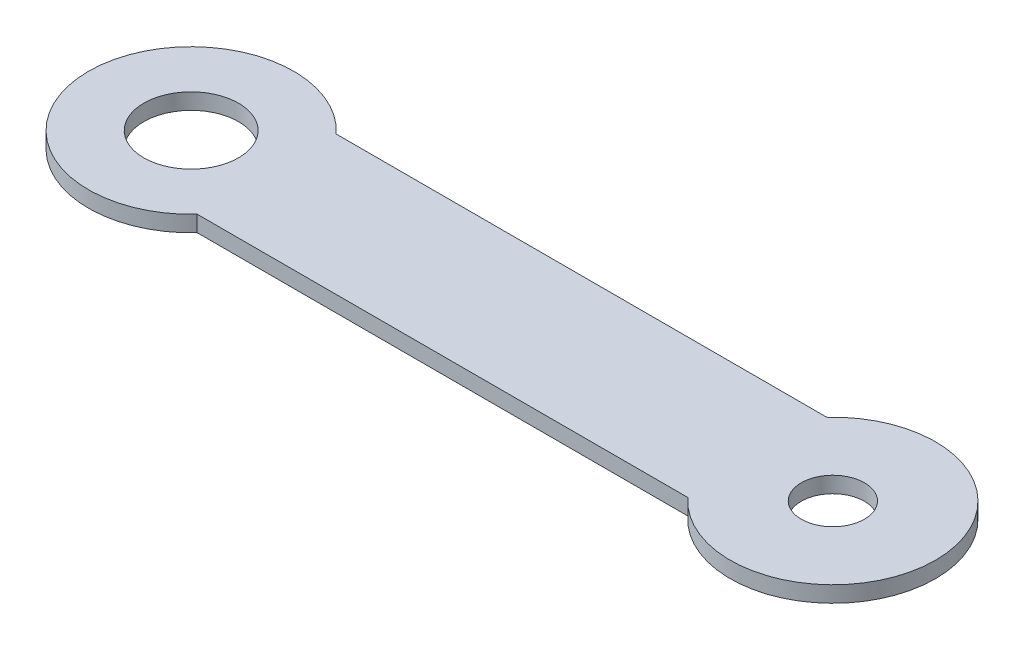
ISO-10303-21;
HEADER;
FILE_DESCRIPTION(('STEP AP214'),'2;1');
FILE_NAME('part.step','',(''),(''),'','','');
FILE_SCHEMA(('AUTOMOTIVE_DESIGN { 1 0 10303 214 1 1 1 1 }'));
ENDSEC;
DATA;
#1=APPLICATION_CONTEXT('core data for automotive mechanical design processes');
#2=APPLICATION_PROTOCOL_DEFINITION('international standard','automotive_design',2000,#1);
#3=PRODUCT_CONTEXT('',#1,'mechanical');
#4=PRODUCT('Part','Part','',(#3));
#5=PRODUCT_RELATED_PRODUCT_CATEGORY('part','',(#4));
#6=PRODUCT_DEFINITION_FORMATION('','',#4);
#7=PRODUCT_DEFINITION_CONTEXT('part definition',#1,'design');
#8=PRODUCT_DEFINITION('design','',#6,#7);
#9=PRODUCT_DEFINITION_SHAPE('','',#8);
#10=(LENGTH_UNIT() NAMED_UNIT(*) SI_UNIT(.MILLI.,.METRE.));
#11=(NAMED_UNIT(*) PLANE_ANGLE_UNIT() SI_UNIT($,.RADIAN.));
#12=(NAMED_UNIT(*) SI_UNIT($,.STERADIAN.) SOLID_ANGLE_UNIT());
#13=UNCERTAINTY_MEASURE_WITH_UNIT(LENGTH_MEASURE(1.E-05),#10,'distance_accuracy_value','');
#14=(GEOMETRIC_REPRESENTATION_CONTEXT(3) GLOBAL_UNCERTAINTY_ASSIGNED_CONTEXT((#13)) GLOBAL_UNIT_ASSIGNED_CONTEXT((#10,
#11,#12)) REPRESENTATION_CONTEXT('',''));
#15=CARTESIAN_POINT('',(0.,0.,0.));
#16=DIRECTION('',(0.,0.,1.));
#17=DIRECTION('',(1.,0.,0.));
#18=AXIS2_PLACEMENT_3D('',#15,#16,#17);
#19=CARTESIAN_POINT('',(50.8,2.54,0.));
#20=DIRECTION('',(0.,-1.,0.));
#21=DIRECTION('',(0.,0.,-1.));
#22=AXIS2_PLACEMENT_3D('',#19,#20,#21);
#23=CYLINDRICAL_SURFACE('',#22,16.252288298);
#24=CARTESIAN_POINT('',(50.8,0.,0.));
#25=DIRECTION('',(0.,1.,0.));
#26=DIRECTION('',(0.,0.,1.));
#27=AXIS2_PLACEMENT_3D('',#24,#25,#26);
#28=CIRCLE('',#27,16.252288298);
#29=CARTESIAN_POINT('',(38.8360175977517,0.,11.));
#30=VERTEX_POINT('',#29);
#31=CARTESIAN_POINT('',(38.8360175977517,0.,-11.));
#32=VERTEX_POINT('',#31);
#33=EDGE_CURVE('E96',#30,#32,#28,.T.);
#34=ORIENTED_EDGE('',*,*,#33,.T.);
#35=DIRECTION('',(0.,-1.,0.));
#36=VECTOR('',#35,1.);
#37=CARTESIAN_POINT('',(38.8360175977517,2.54,-11.));
#38=LINE('',#37,#36);
#39=CARTESIAN_POINT('',(38.8360175977517,2.54,-11.));
#40=VERTEX_POINT('',#39);
#41=EDGE_CURVE('E11',#40,#32,#38,.T.);
#42=ORIENTED_EDGE('',*,*,#41,.F.);
#43=CARTESIAN_POINT('',(50.8,2.54,0.));
#44=DIRECTION('',(0.,1.,0.));
#45=DIRECTION('',(0.,0.,1.));
#46=AXIS2_PLACEMENT_3D('',#43,#44,#45);
#47=CIRCLE('',#46,16.252288298);
#48=CARTESIAN_POINT('',(38.8360175977517,2.54,11.));
#49=VERTEX_POINT('',#48);
#50=EDGE_CURVE('E84',#49,#40,#47,.T.);
#51=ORIENTED_EDGE('',*,*,#50,.F.);
#52=DIRECTION('',(0.,-1.,0.));
#53=VECTOR('',#52,1.);
#54=CARTESIAN_POINT('',(38.8360175977517,2.54,11.));
#55=LINE('',#54,#53);
#56=EDGE_CURVE('E92',#49,#30,#55,.T.);
#57=ORIENTED_EDGE('',*,*,#56,.T.);
#58=EDGE_LOOP('',(#34,#42,#51,#57));
#59=FACE_BOUND('',#58,.T.);
#60=ADVANCED_FACE('F33',(#59),#23,.T.);
#61=CARTESIAN_POINT('',(-38.8360177238845,2.54,-11.));
#62=DIRECTION('',(0.,0.,1.));
#63=DIRECTION('',(1.,0.,0.));
#64=AXIS2_PLACEMENT_3D('',#61,#62,#63);
#65=PLANE('',#64);
#66=DIRECTION('',(-1.,0.,0.));
#67=VECTOR('',#66,1.);
#68=CARTESIAN_POINT('',(-38.8360177238845,0.,-11.));
#69=LINE('',#68,#67);
#70=CARTESIAN_POINT('',(-38.8360177238845,0.,-11.));
#71=VERTEX_POINT('',#70);
#72=EDGE_CURVE('E88',#32,#71,#69,.T.);
#73=ORIENTED_EDGE('',*,*,#72,.T.);
#74=DIRECTION('',(0.,-1.,0.));
#75=VECTOR('',#74,1.);
#76=CARTESIAN_POINT('',(-38.8360177238845,2.54,-11.));
#77=LINE('',#76,#75);
#78=CARTESIAN_POINT('',(-38.8360177238845,2.54,-11.));
#79=VERTEX_POINT('',#78);
#80=EDGE_CURVE('E41',#79,#71,#77,.T.);
#81=ORIENTED_EDGE('',*,*,#80,.F.);
#82=DIRECTION('',(-1.,0.,0.));
#83=VECTOR('',#82,1.);
#84=CARTESIAN_POINT('',(-38.8360177238845,2.54,-11.));
#85=LINE('',#84,#83);
#86=EDGE_CURVE('E79',#40,#79,#85,.T.);
#87=ORIENTED_EDGE('',*,*,#86,.F.);
#88=ORIENTED_EDGE('',*,*,#41,.T.);
#89=EDGE_LOOP('',(#73,#81,#87,#88));
#90=FACE_BOUND('',#89,.T.);
#91=ADVANCED_FACE('F87',(#90),#65,.F.);
#92=CARTESIAN_POINT('',(-50.8,2.54,0.));
#93=DIRECTION('',(0.,-1.,0.));
#94=DIRECTION('',(0.,0.,-1.));
#95=AXIS2_PLACEMENT_3D('',#92,#93,#94);
#96=CYLINDRICAL_SURFACE('',#95,16.2522882051484);
#97=CARTESIAN_POINT('',(-50.8,0.,0.));
#98=DIRECTION('',(0.,1.,0.));
#99=DIRECTION('',(0.,0.,1.));
#100=AXIS2_PLACEMENT_3D('',#97,#98,#99);
#101=CIRCLE('',#100,16.2522882051484);
#102=CARTESIAN_POINT('',(-38.8360177238845,0.,11.));
#103=VERTEX_POINT('',#102);
#104=EDGE_CURVE('E66',#71,#103,#101,.T.);
#105=ORIENTED_EDGE('',*,*,#104,.T.);
#106=DIRECTION('',(0.,-1.,0.));
#107=VECTOR('',#106,1.);
#108=CARTESIAN_POINT('',(-38.8360177238845,2.54,11.));
#109=LINE('',#108,#107);
#110=CARTESIAN_POINT('',(-38.8360177238845,2.54,11.));
#111=VERTEX_POINT('',#110);
#112=EDGE_CURVE('E89',#111,#103,#109,.T.);
#113=ORIENTED_EDGE('',*,*,#112,.F.);
#114=CARTESIAN_POINT('',(-50.8,2.54,0.));
#115=DIRECTION('',(0.,1.,0.));
#116=DIRECTION('',(0.,0.,1.));
#117=AXIS2_PLACEMENT_3D('',#114,#115,#116);
#118=CIRCLE('',#117,16.2522882051484);
#119=EDGE_CURVE('E82',#79,#111,#118,.T.);
#120=ORIENTED_EDGE('',*,*,#119,.F.);
#121=ORIENTED_EDGE('',*,*,#80,.T.);
#122=EDGE_LOOP('',(#105,#113,#120,#121));
#123=FACE_BOUND('',#122,.T.);
#124=ADVANCED_FACE('F90',(#123),#96,.T.);
#125=CARTESIAN_POINT('',(-38.8360177238845,2.54,11.));
#126=DIRECTION('',(0.,0.,-1.));
#127=DIRECTION('',(-1.,0.,0.));
#128=AXIS2_PLACEMENT_3D('',#125,#126,#127);
#129=PLANE('',#128);
#130=DIRECTION('',(1.,0.,0.));
#131=VECTOR('',#130,1.);
#132=CARTESIAN_POINT('',(-38.8360177238845,0.,11.));
#133=LINE('',#132,#131);
#134=EDGE_CURVE('E72',#103,#30,#133,.T.);
#135=ORIENTED_EDGE('',*,*,#134,.T.);
#136=ORIENTED_EDGE('',*,*,#56,.F.);
#137=DIRECTION('',(1.,0.,0.));
#138=VECTOR('',#137,1.);
#139=CARTESIAN_POINT('',(-38.8360177238845,2.54,11.));
#140=LINE('',#139,#138);
#141=EDGE_CURVE('E49',#111,#49,#140,.T.);
#142=ORIENTED_EDGE('',*,*,#141,.F.);
#143=ORIENTED_EDGE('',*,*,#112,.T.);
#144=EDGE_LOOP('',(#135,#136,#142,#143));
#145=FACE_BOUND('',#144,.T.);
#146=ADVANCED_FACE('F104',(#145),#129,.F.);
#147=CARTESIAN_POINT('',(50.8,2.54,0.));
#148=DIRECTION('',(0.,1.,0.));
#149=DIRECTION('',(0.,0.,1.));
#150=AXIS2_PLACEMENT_3D('',#147,#148,#149);
#151=PLANE('',#150);
#152=CARTESIAN_POINT('',(-50.8,2.54,0.));
#153=DIRECTION('',(0.,1.,0.));
#154=DIRECTION('',(0.,0.,1.));
#155=AXIS2_PLACEMENT_3D('',#152,#153,#154);
#156=CIRCLE('',#155,7.5);
#157=CARTESIAN_POINT('',(-50.8,2.54,7.5));
#158=VERTEX_POINT('',#157);
#159=EDGE_CURVE('E116',#158,#158,#156,.T.);
#160=ORIENTED_EDGE('',*,*,#159,.F.);
#161=EDGE_LOOP('',(#160));
#162=FACE_BOUND('',#161,.T.);
#163=CARTESIAN_POINT('',(50.8,2.54,0.));
#164=DIRECTION('',(0.,1.,0.));
#165=DIRECTION('',(0.,0.,1.));
#166=AXIS2_PLACEMENT_3D('',#163,#164,#165);
#167=CIRCLE('',#166,5.);
#168=CARTESIAN_POINT('',(50.8,2.54,5.));
#169=VERTEX_POINT('',#168);
#170=EDGE_CURVE('E110',#169,#169,#167,.T.);
#171=ORIENTED_EDGE('',*,*,#170,.F.);
#172=EDGE_LOOP('',(#171));
#173=FACE_BOUND('',#172,.T.);
#174=ORIENTED_EDGE('',*,*,#50,.T.);
#175=ORIENTED_EDGE('',*,*,#86,.T.);
#176=ORIENTED_EDGE('',*,*,#119,.T.);
#177=ORIENTED_EDGE('',*,*,#141,.T.);
#178=EDGE_LOOP('',(#174,#175,#176,#177));
#179=FACE_BOUND('',#178,.T.);
#180=ADVANCED_FACE('F80',(#162,#173,#179),#151,.T.);
#181=CARTESIAN_POINT('',(50.8,0.,0.));
#182=DIRECTION('',(0.,1.,0.));
#183=DIRECTION('',(0.,0.,1.));
#184=AXIS2_PLACEMENT_3D('',#181,#182,#183);
#185=PLANE('',#184);
#186=CARTESIAN_POINT('',(-50.8,0.,0.));
#187=DIRECTION('',(0.,1.,0.));
#188=DIRECTION('',(0.,0.,1.));
#189=AXIS2_PLACEMENT_3D('',#186,#187,#188);
#190=CIRCLE('',#189,7.5);
#191=CARTESIAN_POINT('',(-50.8,0.,7.5));
#192=VERTEX_POINT('',#191);
#193=EDGE_CURVE('E99',#192,#192,#190,.T.);
#194=ORIENTED_EDGE('',*,*,#193,.T.);
#195=EDGE_LOOP('',(#194));
#196=FACE_BOUND('',#195,.T.);
#197=CARTESIAN_POINT('',(50.8,0.,0.));
#198=DIRECTION('',(0.,1.,0.));
#199=DIRECTION('',(0.,0.,1.));
#200=AXIS2_PLACEMENT_3D('',#197,#198,#199);
#201=CIRCLE('',#200,5.);
#202=CARTESIAN_POINT('',(50.8,0.,5.));
#203=VERTEX_POINT('',#202);
#204=EDGE_CURVE('E113',#203,#203,#201,.T.);
#205=ORIENTED_EDGE('',*,*,#204,.T.);
#206=EDGE_LOOP('',(#205));
#207=FACE_BOUND('',#206,.T.);
#208=ORIENTED_EDGE('',*,*,#33,.F.);
#209=ORIENTED_EDGE('',*,*,#134,.F.);
#210=ORIENTED_EDGE('',*,*,#104,.F.);
#211=ORIENTED_EDGE('',*,*,#72,.F.);
#212=EDGE_LOOP('',(#208,#209,#210,#211));
#213=FACE_BOUND('',#212,.T.);
#214=ADVANCED_FACE('F107',(#196,#207,#213),#185,.F.);
#215=CARTESIAN_POINT('',(50.8,0.,0.));
#216=DIRECTION('',(0.,1.,0.));
#217=DIRECTION('',(0.,0.,1.));
#218=AXIS2_PLACEMENT_3D('',#215,#216,#217);
#219=CYLINDRICAL_SURFACE('',#218,5.);
#220=ORIENTED_EDGE('',*,*,#204,.F.);
#221=EDGE_LOOP('',(#220));
#222=FACE_BOUND('',#221,.T.);
#223=ORIENTED_EDGE('',*,*,#170,.T.);
#224=EDGE_LOOP('',(#223));
#225=FACE_BOUND('',#224,.T.);
#226=ADVANCED_FACE('F127',(#222,#225),#219,.F.);
#227=CARTESIAN_POINT('',(-50.8,0.,0.));
#228=DIRECTION('',(0.,1.,0.));
#229=DIRECTION('',(0.,0.,1.));
#230=AXIS2_PLACEMENT_3D('',#227,#228,#229);
#231=CYLINDRICAL_SURFACE('',#230,7.5);
#232=ORIENTED_EDGE('',*,*,#193,.F.);
#233=EDGE_LOOP('',(#232));
#234=FACE_BOUND('',#233,.T.);
#235=ORIENTED_EDGE('',*,*,#159,.T.);
#236=EDGE_LOOP('',(#235));
#237=FACE_BOUND('',#236,.T.);
#238=ADVANCED_FACE('F124',(#234,#237),#231,.F.);
#239=CLOSED_SHELL('',(#60,#91,#124,#146,#180,#214,#226,#238));
#240=MANIFOLD_SOLID_BREP('B2',#239);
#241=ADVANCED_BREP_SHAPE_REPRESENTATION('',(#18,#240),#14);
#242=SHAPE_DEFINITION_REPRESENTATION(#9,#241);
ENDSEC;
END-ISO-10303-21;
